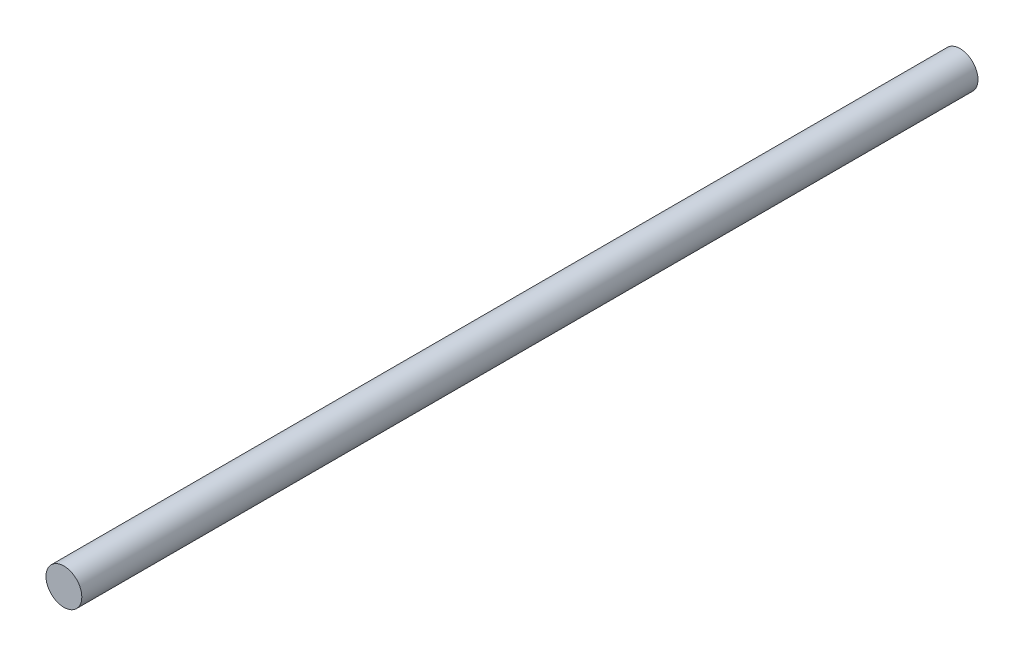
ISO-10303-21;
HEADER;
FILE_DESCRIPTION(('STEP AP214'),'2;1');
FILE_NAME('part.step','',(''),(''),'','','');
FILE_SCHEMA(('AUTOMOTIVE_DESIGN { 1 0 10303 214 1 1 1 1 }'));
ENDSEC;
DATA;
#1=APPLICATION_CONTEXT('core data for automotive mechanical design processes');
#2=APPLICATION_PROTOCOL_DEFINITION('international standard','automotive_design',2000,#1);
#3=PRODUCT_CONTEXT('',#1,'mechanical');
#4=PRODUCT('Part','Part','',(#3));
#5=PRODUCT_RELATED_PRODUCT_CATEGORY('part','',(#4));
#6=PRODUCT_DEFINITION_FORMATION('','',#4);
#7=PRODUCT_DEFINITION_CONTEXT('part definition',#1,'design');
#8=PRODUCT_DEFINITION('design','',#6,#7);
#9=PRODUCT_DEFINITION_SHAPE('','',#8);
#10=(LENGTH_UNIT() NAMED_UNIT(*) SI_UNIT(.MILLI.,.METRE.));
#11=(NAMED_UNIT(*) PLANE_ANGLE_UNIT() SI_UNIT($,.RADIAN.));
#12=(NAMED_UNIT(*) SI_UNIT($,.STERADIAN.) SOLID_ANGLE_UNIT());
#13=UNCERTAINTY_MEASURE_WITH_UNIT(LENGTH_MEASURE(1.E-05),#10,'distance_accuracy_value','');
#14=(GEOMETRIC_REPRESENTATION_CONTEXT(3) GLOBAL_UNCERTAINTY_ASSIGNED_CONTEXT((#13)) GLOBAL_UNIT_ASSIGNED_CONTEXT((#10,
#11,#12)) REPRESENTATION_CONTEXT('',''));
#15=CARTESIAN_POINT('',(0.,0.,0.));
#16=DIRECTION('',(0.,0.,1.));
#17=DIRECTION('',(1.,0.,0.));
#18=AXIS2_PLACEMENT_3D('',#15,#16,#17);
#19=CARTESIAN_POINT('',(0.,0.,250.));
#20=DIRECTION('',(0.,0.,-1.));
#21=DIRECTION('',(-1.,0.,0.));
#22=AXIS2_PLACEMENT_3D('',#19,#20,#21);
#23=CYLINDRICAL_SURFACE('',#22,5.);
#24=CARTESIAN_POINT('',(0.,0.,250.));
#25=DIRECTION('',(0.,0.,1.));
#26=DIRECTION('',(1.,0.,0.));
#27=AXIS2_PLACEMENT_3D('',#24,#25,#26);
#28=CIRCLE('',#27,5.);
#29=CARTESIAN_POINT('',(5.,0.,250.));
#30=VERTEX_POINT('',#29);
#31=EDGE_CURVE('E10',#30,#30,#28,.T.);
#32=ORIENTED_EDGE('',*,*,#31,.F.);
#33=EDGE_LOOP('',(#32));
#34=FACE_BOUND('',#33,.T.);
#35=CARTESIAN_POINT('',(0.,0.,0.));
#36=DIRECTION('',(0.,0.,1.));
#37=DIRECTION('',(1.,0.,0.));
#38=AXIS2_PLACEMENT_3D('',#35,#36,#37);
#39=CIRCLE('',#38,5.);
#40=CARTESIAN_POINT('',(5.,0.,0.));
#41=VERTEX_POINT('',#40);
#42=EDGE_CURVE('E40',#41,#41,#39,.T.);
#43=ORIENTED_EDGE('',*,*,#42,.T.);
#44=EDGE_LOOP('',(#43));
#45=FACE_BOUND('',#44,.T.);
#46=ADVANCED_FACE('F37',(#34,#45),#23,.T.);
#47=CARTESIAN_POINT('',(0.,0.,250.));
#48=DIRECTION('',(0.,0.,1.));
#49=DIRECTION('',(1.,0.,0.));
#50=AXIS2_PLACEMENT_3D('',#47,#48,#49);
#51=PLANE('',#50);
#52=ORIENTED_EDGE('',*,*,#31,.T.);
#53=EDGE_LOOP('',(#52));
#54=FACE_BOUND('',#53,.T.);
#55=ADVANCED_FACE('F54',(#54),#51,.T.);
#56=CARTESIAN_POINT('',(0.,0.,0.));
#57=DIRECTION('',(0.,0.,1.));
#58=DIRECTION('',(1.,0.,0.));
#59=AXIS2_PLACEMENT_3D('',#56,#57,#58);
#60=PLANE('',#59);
#61=ORIENTED_EDGE('',*,*,#42,.F.);
#62=EDGE_LOOP('',(#61));
#63=FACE_BOUND('',#62,.T.);
#64=ADVANCED_FACE('F52',(#63),#60,.F.);
#65=CLOSED_SHELL('',(#46,#55,#64));
#66=MANIFOLD_SOLID_BREP('B2',#65);
#67=ADVANCED_BREP_SHAPE_REPRESENTATION('',(#18,#66),#14);
#68=SHAPE_DEFINITION_REPRESENTATION(#9,#67);
ENDSEC;
END-ISO-10303-21;
